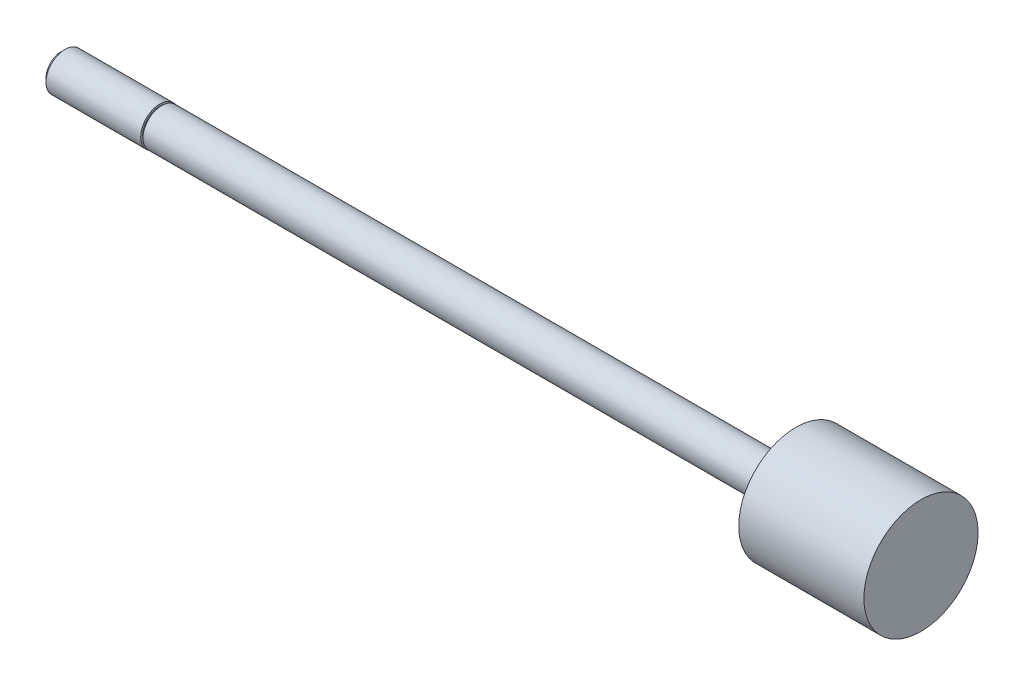
ISO-10303-21;
HEADER;
FILE_DESCRIPTION(('STEP AP214'),'2;1');
FILE_NAME('part.step','',(''),(''),'','','');
FILE_SCHEMA(('AUTOMOTIVE_DESIGN { 1 0 10303 214 1 1 1 1 }'));
ENDSEC;
DATA;
#1=APPLICATION_CONTEXT('core data for automotive mechanical design processes');
#2=APPLICATION_PROTOCOL_DEFINITION('international standard','automotive_design',2000,#1);
#3=PRODUCT_CONTEXT('',#1,'mechanical');
#4=PRODUCT('Part','Part','',(#3));
#5=PRODUCT_RELATED_PRODUCT_CATEGORY('part','',(#4));
#6=PRODUCT_DEFINITION_FORMATION('','',#4);
#7=PRODUCT_DEFINITION_CONTEXT('part definition',#1,'design');
#8=PRODUCT_DEFINITION('design','',#6,#7);
#9=PRODUCT_DEFINITION_SHAPE('','',#8);
#10=(LENGTH_UNIT() NAMED_UNIT(*) SI_UNIT(.MILLI.,.METRE.));
#11=(NAMED_UNIT(*) PLANE_ANGLE_UNIT() SI_UNIT($,.RADIAN.));
#12=(NAMED_UNIT(*) SI_UNIT($,.STERADIAN.) SOLID_ANGLE_UNIT());
#13=UNCERTAINTY_MEASURE_WITH_UNIT(LENGTH_MEASURE(1.E-05),#10,'distance_accuracy_value','');
#14=(GEOMETRIC_REPRESENTATION_CONTEXT(3) GLOBAL_UNCERTAINTY_ASSIGNED_CONTEXT((#13)) GLOBAL_UNIT_ASSIGNED_CONTEXT((#10,
#11,#12)) REPRESENTATION_CONTEXT('',''));
#15=CARTESIAN_POINT('',(0.,0.,0.));
#16=DIRECTION('',(0.,0.,1.));
#17=DIRECTION('',(1.,0.,0.));
#18=AXIS2_PLACEMENT_3D('',#15,#16,#17);
#19=CARTESIAN_POINT('',(-12.7,0.,0.));
#20=DIRECTION('',(1.,0.,0.));
#21=DIRECTION('',(0.,0.,-1.));
#22=AXIS2_PLACEMENT_3D('',#19,#20,#21);
#23=PLANE('',#22);
#24=CARTESIAN_POINT('',(-12.7000000000521,0.,0.));
#25=DIRECTION('',(1.,0.,0.));
#26=DIRECTION('',(0.,0.,-1.));
#27=AXIS2_PLACEMENT_3D('',#24,#25,#26);
#28=CIRCLE('',#27,1.94055999992315);
#29=CARTESIAN_POINT('',(-12.7000000000521,0.,-1.94055999992315));
#30=VERTEX_POINT('',#29);
#31=EDGE_CURVE('E17',#30,#30,#28,.T.);
#32=ORIENTED_EDGE('',*,*,#31,.F.);
#33=EDGE_LOOP('',(#32));
#34=FACE_BOUND('',#33,.T.);
#35=ADVANCED_FACE('F14',(#34),#23,.F.);
#36=CARTESIAN_POINT('',(-12.2275600000421,0.,0.));
#37=DIRECTION('',(1.,0.,0.));
#38=DIRECTION('',(0.,0.,-1.));
#39=AXIS2_PLACEMENT_3D('',#36,#37,#38);
#40=CONICAL_SURFACE('',#39,2.41299999993316,0.785398163397448);
#41=ORIENTED_EDGE('',*,*,#31,.T.);
#42=EDGE_LOOP('',(#41));
#43=FACE_BOUND('',#42,.T.);
#44=CARTESIAN_POINT('',(-12.22756,0.,0.));
#45=DIRECTION('',(-1.,0.,0.));
#46=DIRECTION('',(0.,0.,1.));
#47=AXIS2_PLACEMENT_3D('',#44,#45,#46);
#48=CIRCLE('',#47,2.413);
#49=CARTESIAN_POINT('',(-12.22756,0.,2.413));
#50=VERTEX_POINT('',#49);
#51=EDGE_CURVE('E44',#50,#50,#48,.F.);
#52=ORIENTED_EDGE('',*,*,#51,.F.);
#53=EDGE_LOOP('',(#52));
#54=FACE_BOUND('',#53,.T.);
#55=ADVANCED_FACE('F53',(#43,#54),#40,.T.);
#56=CARTESIAN_POINT('',(0.,0.,0.));
#57=DIRECTION('',(-1.,0.,0.));
#58=DIRECTION('',(0.,0.,1.));
#59=AXIS2_PLACEMENT_3D('',#56,#57,#58);
#60=CYLINDRICAL_SURFACE('',#59,2.413);
#61=ORIENTED_EDGE('',*,*,#51,.T.);
#62=EDGE_LOOP('',(#61));
#63=FACE_BOUND('',#62,.T.);
#64=CARTESIAN_POINT('',(-0.254,0.,0.));
#65=DIRECTION('',(-1.,0.,0.));
#66=DIRECTION('',(0.,0.,1.));
#67=AXIS2_PLACEMENT_3D('',#64,#65,#66);
#68=CIRCLE('',#67,2.413);
#69=CARTESIAN_POINT('',(-0.254,0.,2.413));
#70=VERTEX_POINT('',#69);
#71=EDGE_CURVE('E42',#70,#70,#68,.T.);
#72=ORIENTED_EDGE('',*,*,#71,.T.);
#73=EDGE_LOOP('',(#72));
#74=FACE_BOUND('',#73,.T.);
#75=ADVANCED_FACE('F61',(#63,#74),#60,.T.);
#76=CARTESIAN_POINT('',(95.9866,7.21995,0.));
#77=DIRECTION('',(-1.,0.,0.));
#78=DIRECTION('',(0.,0.,1.));
#79=AXIS2_PLACEMENT_3D('',#76,#77,#78);
#80=PLANE('',#79);
#81=CARTESIAN_POINT('',(95.9866,0.,0.));
#82=DIRECTION('',(-1.,0.,0.));
#83=DIRECTION('',(0.,0.,1.));
#84=AXIS2_PLACEMENT_3D('',#81,#82,#83);
#85=CIRCLE('',#84,7.21995);
#86=CARTESIAN_POINT('',(95.9866,0.,7.21995));
#87=VERTEX_POINT('',#86);
#88=EDGE_CURVE('E40',#87,#87,#85,.T.);
#89=ORIENTED_EDGE('',*,*,#88,.F.);
#90=EDGE_LOOP('',(#89));
#91=FACE_BOUND('',#90,.T.);
#92=ADVANCED_FACE('F88',(#91),#80,.F.);
#93=CARTESIAN_POINT('',(-0.254,2.667,0.));
#94=DIRECTION('',(-1.,0.,0.));
#95=DIRECTION('',(0.,0.,1.));
#96=AXIS2_PLACEMENT_3D('',#93,#94,#95);
#97=PLANE('',#96);
#98=ORIENTED_EDGE('',*,*,#71,.F.);
#99=EDGE_LOOP('',(#98));
#100=FACE_BOUND('',#99,.T.);
#101=CARTESIAN_POINT('',(-0.254,0.,0.));
#102=DIRECTION('',(-1.,0.,0.));
#103=DIRECTION('',(0.,0.,1.));
#104=AXIS2_PLACEMENT_3D('',#101,#102,#103);
#105=CIRCLE('',#104,2.159);
#106=CARTESIAN_POINT('',(-0.254,0.,2.159));
#107=VERTEX_POINT('',#106);
#108=EDGE_CURVE('E37',#107,#107,#105,.F.);
#109=ORIENTED_EDGE('',*,*,#108,.F.);
#110=EDGE_LOOP('',(#109));
#111=FACE_BOUND('',#110,.T.);
#112=ADVANCED_FACE('F84',(#100,#111),#97,.F.);
#113=CARTESIAN_POINT('',(95.9866,0.,0.));
#114=DIRECTION('',(-1.,0.,0.));
#115=DIRECTION('',(0.,0.,1.));
#116=AXIS2_PLACEMENT_3D('',#113,#114,#115);
#117=CYLINDRICAL_SURFACE('',#116,7.21995);
#118=CARTESIAN_POINT('',(80.1624,0.,0.));
#119=DIRECTION('',(-1.,0.,0.));
#120=DIRECTION('',(0.,0.,1.));
#121=AXIS2_PLACEMENT_3D('',#118,#119,#120);
#122=CIRCLE('',#121,7.21995);
#123=CARTESIAN_POINT('',(80.1624,0.,7.21995));
#124=VERTEX_POINT('',#123);
#125=EDGE_CURVE('E34',#124,#124,#122,.F.);
#126=ORIENTED_EDGE('',*,*,#125,.T.);
#127=EDGE_LOOP('',(#126));
#128=FACE_BOUND('',#127,.T.);
#129=ORIENTED_EDGE('',*,*,#88,.T.);
#130=EDGE_LOOP('',(#129));
#131=FACE_BOUND('',#130,.T.);
#132=ADVANCED_FACE('F80',(#128,#131),#117,.T.);
#133=CARTESIAN_POINT('',(0.,0.,0.));
#134=DIRECTION('',(-1.,0.,0.));
#135=DIRECTION('',(0.,0.,1.));
#136=AXIS2_PLACEMENT_3D('',#133,#134,#135);
#137=CYLINDRICAL_SURFACE('',#136,2.159);
#138=ORIENTED_EDGE('',*,*,#108,.T.);
#139=EDGE_LOOP('',(#138));
#140=FACE_BOUND('',#139,.T.);
#141=CARTESIAN_POINT('',(0.,0.,0.));
#142=DIRECTION('',(-1.,0.,0.));
#143=DIRECTION('',(0.,0.,1.));
#144=AXIS2_PLACEMENT_3D('',#141,#142,#143);
#145=CIRCLE('',#144,2.159);
#146=CARTESIAN_POINT('',(0.,0.,2.159));
#147=VERTEX_POINT('',#146);
#148=EDGE_CURVE('E26',#147,#147,#145,.T.);
#149=ORIENTED_EDGE('',*,*,#148,.T.);
#150=EDGE_LOOP('',(#149));
#151=FACE_BOUND('',#150,.T.);
#152=ADVANCED_FACE('F76',(#140,#151),#137,.T.);
#153=CARTESIAN_POINT('',(80.1624,2.3749,0.));
#154=DIRECTION('',(1.,0.,0.));
#155=DIRECTION('',(0.,0.,-1.));
#156=AXIS2_PLACEMENT_3D('',#153,#154,#155);
#157=PLANE('',#156);
#158=CARTESIAN_POINT('',(80.1624,0.,0.));
#159=DIRECTION('',(-1.,0.,0.));
#160=DIRECTION('',(0.,0.,1.));
#161=AXIS2_PLACEMENT_3D('',#158,#159,#160);
#162=CIRCLE('',#161,2.3749);
#163=CARTESIAN_POINT('',(80.1624,0.,2.3749));
#164=VERTEX_POINT('',#163);
#165=EDGE_CURVE('E21',#164,#164,#162,.T.);
#166=ORIENTED_EDGE('',*,*,#165,.F.);
#167=EDGE_LOOP('',(#166));
#168=FACE_BOUND('',#167,.T.);
#169=ORIENTED_EDGE('',*,*,#125,.F.);
#170=EDGE_LOOP('',(#169));
#171=FACE_BOUND('',#170,.T.);
#172=ADVANCED_FACE('F69',(#168,#171),#157,.F.);
#173=CARTESIAN_POINT('',(0.,2.159,0.));
#174=DIRECTION('',(1.,0.,0.));
#175=DIRECTION('',(0.,0.,-1.));
#176=AXIS2_PLACEMENT_3D('',#173,#174,#175);
#177=PLANE('',#176);
#178=ORIENTED_EDGE('',*,*,#148,.F.);
#179=EDGE_LOOP('',(#178));
#180=FACE_BOUND('',#179,.T.);
#181=CARTESIAN_POINT('',(0.,0.,0.));
#182=DIRECTION('',(-1.,0.,0.));
#183=DIRECTION('',(0.,0.,1.));
#184=AXIS2_PLACEMENT_3D('',#181,#182,#183);
#185=CIRCLE('',#184,2.3749);
#186=CARTESIAN_POINT('',(0.,0.,2.3749));
#187=VERTEX_POINT('',#186);
#188=EDGE_CURVE('E9',#187,#187,#185,.F.);
#189=ORIENTED_EDGE('',*,*,#188,.F.);
#190=EDGE_LOOP('',(#189));
#191=FACE_BOUND('',#190,.T.);
#192=ADVANCED_FACE('F64',(#180,#191),#177,.F.);
#193=CARTESIAN_POINT('',(95.9866,0.,0.));
#194=DIRECTION('',(-1.,0.,0.));
#195=DIRECTION('',(0.,0.,1.));
#196=AXIS2_PLACEMENT_3D('',#193,#194,#195);
#197=CYLINDRICAL_SURFACE('',#196,2.3749);
#198=ORIENTED_EDGE('',*,*,#188,.T.);
#199=EDGE_LOOP('',(#198));
#200=FACE_BOUND('',#199,.T.);
#201=ORIENTED_EDGE('',*,*,#165,.T.);
#202=EDGE_LOOP('',(#201));
#203=FACE_BOUND('',#202,.T.);
#204=ADVANCED_FACE('F62',(#200,#203),#197,.T.);
#205=CLOSED_SHELL('',(#35,#55,#75,#92,#112,#132,#152,#172,#192,#204));
#206=MANIFOLD_SOLID_BREP('B1',#205);
#207=ADVANCED_BREP_SHAPE_REPRESENTATION('',(#18,#206),#14);
#208=SHAPE_DEFINITION_REPRESENTATION(#9,#207);
ENDSEC;
END-ISO-10303-21;
